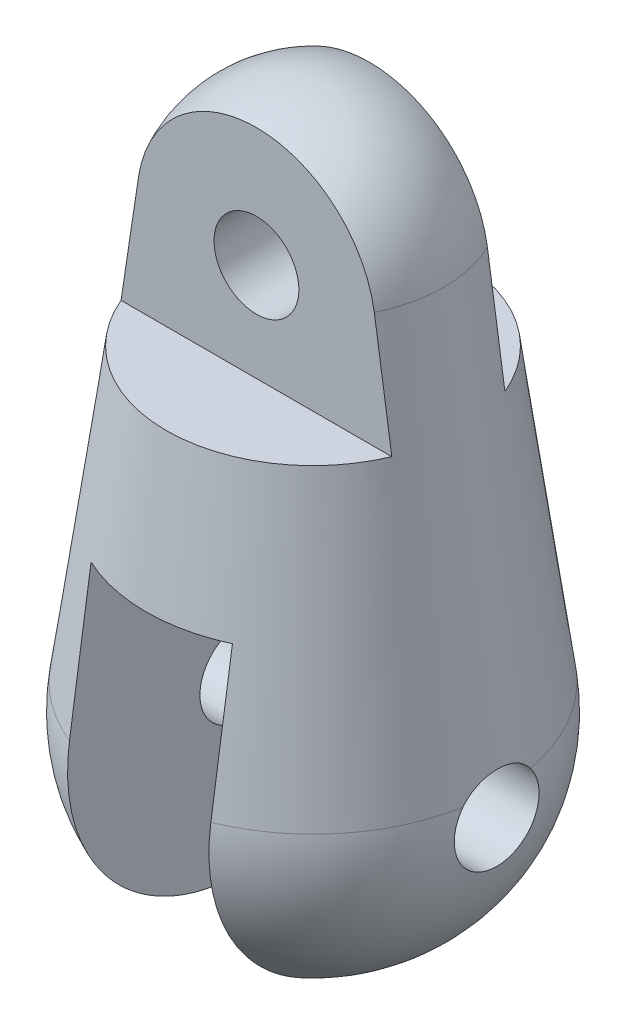
ISO-10303-21;
HEADER;
FILE_DESCRIPTION(('STEP AP214'),'2;1');
FILE_NAME('part.step','',(''),(''),'','','');
FILE_SCHEMA(('AUTOMOTIVE_DESIGN { 1 0 10303 214 1 1 1 1 }'));
ENDSEC;
DATA;
#1=APPLICATION_CONTEXT('core data for automotive mechanical design processes');
#2=APPLICATION_PROTOCOL_DEFINITION('international standard','automotive_design',2000,#1);
#3=PRODUCT_CONTEXT('',#1,'mechanical');
#4=PRODUCT('Part','Part','',(#3));
#5=PRODUCT_RELATED_PRODUCT_CATEGORY('part','',(#4));
#6=PRODUCT_DEFINITION_FORMATION('','',#4);
#7=PRODUCT_DEFINITION_CONTEXT('part definition',#1,'design');
#8=PRODUCT_DEFINITION('design','',#6,#7);
#9=PRODUCT_DEFINITION_SHAPE('','',#8);
#10=(LENGTH_UNIT() NAMED_UNIT(*) SI_UNIT(.MILLI.,.METRE.));
#11=(NAMED_UNIT(*) PLANE_ANGLE_UNIT() SI_UNIT($,.RADIAN.));
#12=(NAMED_UNIT(*) SI_UNIT($,.STERADIAN.) SOLID_ANGLE_UNIT());
#13=UNCERTAINTY_MEASURE_WITH_UNIT(LENGTH_MEASURE(1.E-05),#10,'distance_accuracy_value','');
#14=(GEOMETRIC_REPRESENTATION_CONTEXT(3) GLOBAL_UNCERTAINTY_ASSIGNED_CONTEXT((#13)) GLOBAL_UNIT_ASSIGNED_CONTEXT((#10,
#11,#12)) REPRESENTATION_CONTEXT('',''));
#15=CARTESIAN_POINT('',(0.,0.,0.));
#16=DIRECTION('',(0.,0.,1.));
#17=DIRECTION('',(1.,0.,0.));
#18=AXIS2_PLACEMENT_3D('',#15,#16,#17);
#19=CARTESIAN_POINT('',(0.,45.9090909090909,0.));
#20=DIRECTION('',(0.,-1.,0.));
#21=DIRECTION('',(1.,0.,0.));
#22=AXIS2_PLACEMENT_3D('',#19,#20,#21);
#23=CONICAL_SURFACE('',#22,13.8692239112658,0.136789826924246);
#24=CARTESIAN_POINT('',(19.4871752709508,2.72707272727272,-3.57953549223434));
#25=CARTESIAN_POINT('',(19.4871714866762,2.82761478626232,-3.50295494298203));
#26=CARTESIAN_POINT('',(19.4879661715478,2.92490889222046,-3.42212099023182));
#27=CARTESIAN_POINT('',(19.4908226238969,3.11233932568401,-3.25258004897354));
#28=CARTESIAN_POINT('',(19.4928842569054,3.20247641166085,-3.16387389684424));
#29=CARTESIAN_POINT('',(19.4979430032568,3.37488827849049,-2.97927462224909));
#30=CARTESIAN_POINT('',(19.5009394182816,3.4571688687152,-2.88338690518831));
#31=CARTESIAN_POINT('',(19.5075329575111,3.61337077756257,-2.6850481631585));
#32=CARTESIAN_POINT('',(19.5111300842399,3.68729206105794,-2.58259711061201));
#33=CARTESIAN_POINT('',(19.5186002404263,3.82626321423467,-2.37184404105321));
#34=CARTESIAN_POINT('',(19.5224732903195,3.89131242578348,-2.2635415908138));
#35=CARTESIAN_POINT('',(19.5301908904843,4.01210075478045,-2.04181090338331));
#36=CARTESIAN_POINT('',(19.5340354297305,4.06783643340104,-1.92838079246441));
#37=CARTESIAN_POINT('',(19.5414162802478,4.1695482612747,-1.69729064834706));
#38=CARTESIAN_POINT('',(19.5449527592723,4.21552974197854,-1.57963296719441));
#39=CARTESIAN_POINT('',(19.551483391942,4.29746048775397,-1.34081175074583));
#40=CARTESIAN_POINT('',(19.5544773463867,4.33340607052309,-1.2196469465897));
#41=CARTESIAN_POINT('',(19.5597338733168,4.39504122182331,-0.974483386375186));
#42=CARTESIAN_POINT('',(19.5619950924964,4.42071183359865,-0.850479834339897));
#43=CARTESIAN_POINT('',(19.5656379471728,4.4615228775192,-0.600694358689222));
#44=CARTESIAN_POINT('',(19.5670192754597,4.47665963198473,-0.474911829602854));
#45=CARTESIAN_POINT('',(19.5688162885817,4.49627670644428,-0.222521655833369));
#46=CARTESIAN_POINT('',(19.5692320507228,4.50075787955383,-0.0959140780198559));
#47=CARTESIAN_POINT('',(19.5690728699639,4.49903326543272,0.157227588944714));
#48=CARTESIAN_POINT('',(19.5684979284545,4.49282749320257,0.283761678198672));
#49=CARTESIAN_POINT('',(19.5663965916692,4.46982113322741,0.535341402398182));
#50=CARTESIAN_POINT('',(19.5648740302033,4.45306323330495,0.660390975928169));
#51=CARTESIAN_POINT('',(19.5609744537949,4.40912109589236,0.908586052971791));
#52=CARTESIAN_POINT('',(19.558597735459,4.38194047748032,1.03173220198762));
#53=CARTESIAN_POINT('',(19.5531361900926,4.31733116999907,1.27535964879118));
#54=CARTESIAN_POINT('',(19.550050988425,4.27989705698556,1.39583949958813));
#55=CARTESIAN_POINT('',(19.5433730253587,4.19506977819428,1.63317637105105));
#56=CARTESIAN_POINT('',(19.5397804481999,4.14768022443779,1.75003468807973));
#57=CARTESIAN_POINT('',(19.5323192983984,4.04312498515132,1.97967175319938));
#58=CARTESIAN_POINT('',(19.5284499950423,3.98593281468738,2.09243841910166));
#59=CARTESIAN_POINT('',(19.5207272616732,3.86228806304154,2.31272094878898));
#60=CARTESIAN_POINT('',(19.5168738263259,3.79583890953345,2.42023873631813));
#61=CARTESIAN_POINT('',(19.5094936521427,3.65417937629233,2.62923921184932));
#62=CARTESIAN_POINT('',(19.5059666844104,3.57897521977733,2.73072611014469));
#63=CARTESIAN_POINT('',(19.4995646014668,3.42032186295755,2.9269978447132));
#64=CARTESIAN_POINT('',(19.4966892363031,3.33687584190144,3.02178524125882));
#65=CARTESIAN_POINT('',(19.4920976564218,3.16867692695227,3.19736814124777));
#66=CARTESIAN_POINT('',(19.4903121478901,3.08446409403908,3.27867993057237));
#67=CARTESIAN_POINT('',(19.4878503987993,2.91010899891462,3.43437402380577));
#68=CARTESIAN_POINT('',(19.4871722323246,2.81997731561497,3.50876814604072));
#69=CARTESIAN_POINT('',(19.4871752709508,2.72707272727272,3.57953549223433));
#70=B_SPLINE_CURVE_WITH_KNOTS('',3,(#24,#25,#26,#27,#28,#29,#30,#31,#32,#33,#34,#35,#36,#37,#38,
#39,#40,#41,#42,#43,#44,#45,#46,#47,#48,#49,#50,#51,#52,#53,#54,#55,#56,#57,#58,#59,#60,#61,#62,
#63,#64,#65,#66,#67,#68,#69),.UNSPECIFIED.,.F.,.F.,(4,2,2,2,2,2,2,2,2,2,2,2,2,2,2,2,2,2,2,2,2,2,
4),(0.,0.379032679786271,0.758025137493641,1.13673514857442,1.51544675100284,1.89418643109287,
2.27306564537807,2.65173723516935,3.03054758248365,3.41005362779287,3.78969210345242,
4.16930018317431,4.5489077300678,4.92698938384569,5.30493987512321,5.68309068392969,
6.06110452873084,6.44015628108269,6.8190680494544,7.19771210621582,7.57621066959884,
7.92707952761813,8.27733749367502),.UNSPECIFIED.);
#71=CARTESIAN_POINT('',(19.4871752699051,2.72727272727272,-3.57938311320182));
#72=VERTEX_POINT('',#71);
#73=CARTESIAN_POINT('',(19.4871752699051,2.72727272727272,3.57938311320182));
#74=VERTEX_POINT('',#73);
#75=EDGE_CURVE('E65',#72,#74,#70,.T.);
#76=ORIENTED_EDGE('',*,*,#75,.F.);
#77=CARTESIAN_POINT('',(0.,2.72727272727272,0.));
#78=DIRECTION('',(0.,1.,0.));
#79=DIRECTION('',(-1.,0.,0.));
#80=AXIS2_PLACEMENT_3D('',#77,#78,#79);
#81=CIRCLE('',#80,19.813177016094);
#82=CARTESIAN_POINT('',(7.5,2.72727272727272,-18.3388108521538));
#83=VERTEX_POINT('',#82);
#84=EDGE_CURVE('E131',#72,#83,#81,.T.);
#85=ORIENTED_EDGE('',*,*,#84,.T.);
#86=CARTESIAN_POINT('',(7.50000000000001,60.4678833866813,-9.1941997906631));
#87=CARTESIAN_POINT('',(7.5,59.6111030481808,-9.34638563980166));
#88=CARTESIAN_POINT('',(7.5,58.7540680689737,-9.49713000666336));
#89=CARTESIAN_POINT('',(7.5,57.0395559323497,-9.79607226008006));
#90=CARTESIAN_POINT('',(7.5,56.1820787759375,-9.9442701523952));
#91=CARTESIAN_POINT('',(7.5,53.6090968959411,-10.3855467734735));
#92=CARTESIAN_POINT('',(7.5,51.893023760002,-10.6753116292695));
#93=CARTESIAN_POINT('',(7.5,48.4597839263785,-11.247920437124));
#94=CARTESIAN_POINT('',(7.5,46.742617266087,-11.5307646140335));
#95=CARTESIAN_POINT('',(7.5,43.3073756128075,-12.0909046778875));
#96=CARTESIAN_POINT('',(7.5,41.589300617452,-12.3682005502975));
#97=CARTESIAN_POINT('',(7.5,38.2150560302996,-12.9082343974905));
#98=CARTESIAN_POINT('',(7.5,36.5589123729097,-13.1711346141891));
#99=CARTESIAN_POINT('',(7.5,33.2460692458592,-13.6934112323765));
#100=CARTESIAN_POINT('',(7.5,31.589369775949,-13.9527876322797));
#101=CARTESIAN_POINT('',(7.5,26.6185730502316,-14.7264747119845));
#102=CARTESIAN_POINT('',(7.5,23.3037842104827,-15.236342199295));
#103=CARTESIAN_POINT('',(7.5,16.6728443437066,-16.2473738492367));
#104=CARTESIAN_POINT('',(7.5,13.3566933015871,-16.7485379126225));
#105=CARTESIAN_POINT('',(7.5,6.72339108932616,-17.7442086177347));
#106=CARTESIAN_POINT('',(7.5,3.40623991869986,-18.2387152562277));
#107=CARTESIAN_POINT('',(7.5,-3.2292871168763,-19.2225902824171));
#108=CARTESIAN_POINT('',(7.5,-6.54766308726356,-19.7119579583259));
#109=CARTESIAN_POINT('',(7.5,-13.18502734976,-20.6865312567169));
#110=CARTESIAN_POINT('',(7.5,-16.5040156421473,-21.1717368773041));
#111=CARTESIAN_POINT('',(7.5,-23.1423764140919,-22.1387572365351));
#112=CARTESIAN_POINT('',(7.49999999999999,-26.4617488777798,-22.6205720841841));
#113=CARTESIAN_POINT('',(7.49999999999999,-33.1008973991343,-23.5813907777003));
#114=CARTESIAN_POINT('',(7.49999999999999,-36.4206734564052,-24.0603946263008));
#115=CARTESIAN_POINT('',(7.49999999999999,-39.7406106594086,-24.5382754664104));
#116=B_SPLINE_CURVE_WITH_KNOTS('',3,(#86,#87,#88,#89,#90,#91,#92,#93,#94,#95,#96,#97,#98,#99,
#100,#101,#102,#103,#104,#105,#106,#107,#108,#109,#110,#111,#112,#113,#114,#115),.UNSPECIFIED.,
.F.,.F.,(4,2,2,2,2,2,2,2,2,2,2,2,2,2,4),(0.,2.61057085445666,5.22113580301888,10.4422108584417,
15.6631160567295,20.8840349301015,25.914672113893,30.9453115610393,41.0066109060134,
51.0680249049945,61.1294437904388,71.1922383541426,81.2550374991143,91.3175116576888,
101.379976030042),.UNSPECIFIED.);
#117=CARTESIAN_POINT('',(7.5,18.,-16.0444940547742));
#118=VERTEX_POINT('',#117);
#119=EDGE_CURVE('E312',#118,#83,#116,.T.);
#120=ORIENTED_EDGE('',*,*,#119,.F.);
#121=CARTESIAN_POINT('',(0.,18.,0.));
#122=DIRECTION('',(0.,1.,0.));
#123=DIRECTION('',(0.,0.,1.));
#124=AXIS2_PLACEMENT_3D('',#121,#122,#123);
#125=CIRCLE('',#124,17.7108946548074);
#126=CARTESIAN_POINT('',(-7.5,18.,-16.0444940547742));
#127=VERTEX_POINT('',#126);
#128=EDGE_CURVE('E319',#127,#118,#125,.F.);
#129=ORIENTED_EDGE('',*,*,#128,.F.);
#130=CARTESIAN_POINT('',(-7.5,60.4678833866813,-9.19419979066311));
#131=CARTESIAN_POINT('',(-7.5,59.6111030481808,-9.34638563980167));
#132=CARTESIAN_POINT('',(-7.5,58.7540680689737,-9.49713000666337));
#133=CARTESIAN_POINT('',(-7.5,57.0395559323497,-9.79607226008007));
#134=CARTESIAN_POINT('',(-7.5,56.1820787759375,-9.94427015239521));
#135=CARTESIAN_POINT('',(-7.5,53.6090968959411,-10.3855467734735));
#136=CARTESIAN_POINT('',(-7.5,51.893023760002,-10.6753116292695));
#137=CARTESIAN_POINT('',(-7.5,48.4597839263784,-11.247920437124));
#138=CARTESIAN_POINT('',(-7.5,46.742617266087,-11.5307646140335));
#139=CARTESIAN_POINT('',(-7.5,43.3073756128075,-12.0909046778875));
#140=CARTESIAN_POINT('',(-7.5,41.589300617452,-12.3682005502975));
#141=CARTESIAN_POINT('',(-7.5,38.2150560302996,-12.9082343974905));
#142=CARTESIAN_POINT('',(-7.5,36.5589123729097,-13.1711346141891));
#143=CARTESIAN_POINT('',(-7.5,33.2460692458592,-13.6934112323765));
#144=CARTESIAN_POINT('',(-7.5,31.589369775949,-13.9527876322797));
#145=CARTESIAN_POINT('',(-7.5,26.6185730502316,-14.7264747119845));
#146=CARTESIAN_POINT('',(-7.5,23.3037842104827,-15.236342199295));
#147=CARTESIAN_POINT('',(-7.5,16.6728443437066,-16.2473738492367));
#148=CARTESIAN_POINT('',(-7.5,13.3566933015871,-16.7485379126225));
#149=CARTESIAN_POINT('',(-7.5,6.72339108932616,-17.7442086177347));
#150=CARTESIAN_POINT('',(-7.5,3.40623991869986,-18.2387152562277));
#151=CARTESIAN_POINT('',(-7.5,-3.2292871168763,-19.2225902824171));
#152=CARTESIAN_POINT('',(-7.5,-6.54766308726355,-19.7119579583259));
#153=CARTESIAN_POINT('',(-7.5,-13.18502734976,-20.6865312567169));
#154=CARTESIAN_POINT('',(-7.5,-16.5040156421473,-21.1717368773041));
#155=CARTESIAN_POINT('',(-7.5,-23.1423764140919,-22.1387572365351));
#156=CARTESIAN_POINT('',(-7.5,-26.4617488777798,-22.6205720841841));
#157=CARTESIAN_POINT('',(-7.5,-33.1008973991343,-23.5813907777003));
#158=CARTESIAN_POINT('',(-7.5,-36.4206734564052,-24.0603946263008));
#159=CARTESIAN_POINT('',(-7.5,-39.7406106594085,-24.5382754664104));
#160=B_SPLINE_CURVE_WITH_KNOTS('',3,(#130,#131,#132,#133,#134,#135,#136,#137,#138,#139,#140,
#141,#142,#143,#144,#145,#146,#147,#148,#149,#150,#151,#152,#153,#154,#155,#156,#157,#158,#159),
.UNSPECIFIED.,.F.,.F.,(4,2,2,2,2,2,2,2,2,2,2,2,2,2,4),(0.,2.61057085445666,5.22113580301887,
10.4422108584417,15.6631160567295,20.8840349301015,25.914672113893,30.9453115610393,
41.0066109060134,51.0680249049945,61.1294437904388,71.1922383541425,81.2550374991142,
91.3175116576888,101.379976030042),.UNSPECIFIED.);
#161=CARTESIAN_POINT('',(-7.5,2.72727272727272,-18.3388108521538));
#162=VERTEX_POINT('',#161);
#163=EDGE_CURVE('E325',#127,#162,#160,.T.);
#164=ORIENTED_EDGE('',*,*,#163,.T.);
#165=CARTESIAN_POINT('',(-19.4871752699051,2.72727272727272,-3.57938311320182));
#166=VERTEX_POINT('',#165);
#167=EDGE_CURVE('E141',#162,#166,#81,.T.);
#168=ORIENTED_EDGE('',*,*,#167,.T.);
#169=CARTESIAN_POINT('',(-19.4871752709508,2.72707272727272,3.57953549223434));
#170=CARTESIAN_POINT('',(-19.4871714866762,2.82761478626232,3.50295494298203));
#171=CARTESIAN_POINT('',(-19.4879661715478,2.92490889222046,3.42212099023182));
#172=CARTESIAN_POINT('',(-19.4908226238969,3.11233932568401,3.25258004897354));
#173=CARTESIAN_POINT('',(-19.4928842569054,3.20247641166085,3.16387389684424));
#174=CARTESIAN_POINT('',(-19.4979430032568,3.37488827849049,2.97927462224909));
#175=CARTESIAN_POINT('',(-19.5009394182816,3.4571688687152,2.88338690518831));
#176=CARTESIAN_POINT('',(-19.5075329575111,3.61337077756257,2.6850481631585));
#177=CARTESIAN_POINT('',(-19.5111300842399,3.68729206105794,2.58259711061201));
#178=CARTESIAN_POINT('',(-19.5186002404263,3.82626321423467,2.37184404105321));
#179=CARTESIAN_POINT('',(-19.5224732903195,3.89131242578348,2.2635415908138));
#180=CARTESIAN_POINT('',(-19.5301908904843,4.01210075478045,2.04181090338331));
#181=CARTESIAN_POINT('',(-19.5340354297305,4.06783643340104,1.92838079246441));
#182=CARTESIAN_POINT('',(-19.5414162802478,4.1695482612747,1.69729064834706));
#183=CARTESIAN_POINT('',(-19.5449527592723,4.21552974197854,1.57963296719441));
#184=CARTESIAN_POINT('',(-19.551483391942,4.29746048775397,1.34081175074583));
#185=CARTESIAN_POINT('',(-19.5544773463867,4.33340607052309,1.2196469465897));
#186=CARTESIAN_POINT('',(-19.5597338733168,4.39504122182331,0.974483386375186));
#187=CARTESIAN_POINT('',(-19.5619950924964,4.42071183359865,0.850479834339897));
#188=CARTESIAN_POINT('',(-19.5656379471728,4.4615228775192,0.600694358689222));
#189=CARTESIAN_POINT('',(-19.5670192754597,4.47665963198473,0.474911829602854));
#190=CARTESIAN_POINT('',(-19.5688162885817,4.49627670644428,0.222521655833369));
#191=CARTESIAN_POINT('',(-19.5692320507228,4.50075787955383,0.0959140780198559));
#192=CARTESIAN_POINT('',(-19.5690728699639,4.49903326543272,-0.157227588944714));
#193=CARTESIAN_POINT('',(-19.5684979284545,4.49282749320257,-0.283761678198672));
#194=CARTESIAN_POINT('',(-19.5663965916692,4.46982113322741,-0.535341402398182));
#195=CARTESIAN_POINT('',(-19.5648740302033,4.45306323330495,-0.660390975928169));
#196=CARTESIAN_POINT('',(-19.5609744537949,4.40912109589236,-0.908586052971791));
#197=CARTESIAN_POINT('',(-19.558597735459,4.38194047748032,-1.03173220198762));
#198=CARTESIAN_POINT('',(-19.5531361900926,4.31733116999907,-1.27535964879118));
#199=CARTESIAN_POINT('',(-19.550050988425,4.27989705698556,-1.39583949958813));
#200=CARTESIAN_POINT('',(-19.5433730253587,4.19506977819428,-1.63317637105105));
#201=CARTESIAN_POINT('',(-19.5397804481999,4.14768022443779,-1.75003468807973));
#202=CARTESIAN_POINT('',(-19.5323192983984,4.04312498515132,-1.97967175319938));
#203=CARTESIAN_POINT('',(-19.5284499950423,3.98593281468738,-2.09243841910166));
#204=CARTESIAN_POINT('',(-19.5207272616732,3.86228806304154,-2.31272094878898));
#205=CARTESIAN_POINT('',(-19.5168738263259,3.79583890953345,-2.42023873631813));
#206=CARTESIAN_POINT('',(-19.5094936521427,3.65417937629233,-2.62923921184932));
#207=CARTESIAN_POINT('',(-19.5059666844104,3.57897521977733,-2.73072611014469));
#208=CARTESIAN_POINT('',(-19.4995646014668,3.42032186295755,-2.9269978447132));
#209=CARTESIAN_POINT('',(-19.4966892363031,3.33687584190144,-3.02178524125882));
#210=CARTESIAN_POINT('',(-19.4920976564218,3.16867692695227,-3.19736814124777));
#211=CARTESIAN_POINT('',(-19.4903121478901,3.08446409403908,-3.27867993057237));
#212=CARTESIAN_POINT('',(-19.4878503987993,2.91010899891462,-3.43437402380577));
#213=CARTESIAN_POINT('',(-19.4871722323246,2.81997731561497,-3.50876814604072));
#214=CARTESIAN_POINT('',(-19.4871752709508,2.72707272727272,-3.57953549223433));
#215=B_SPLINE_CURVE_WITH_KNOTS('',3,(#169,#170,#171,#172,#173,#174,#175,#176,#177,#178,#179,
#180,#181,#182,#183,#184,#185,#186,#187,#188,#189,#190,#191,#192,#193,#194,#195,#196,#197,#198,
#199,#200,#201,#202,#203,#204,#205,#206,#207,#208,#209,#210,#211,#212,#213,#214),.UNSPECIFIED.,
.F.,.F.,(4,2,2,2,2,2,2,2,2,2,2,2,2,2,2,2,2,2,2,2,2,2,4),(0.,0.379032679786271,0.758025137493641,
1.13673514857442,1.51544675100284,1.89418643109287,2.27306564537807,2.65173723516935,
3.03054758248365,3.41005362779287,3.78969210345242,4.16930018317431,4.5489077300678,
4.92698938384569,5.30493987512321,5.68309068392969,6.06110452873084,6.44015628108269,
6.8190680494544,7.19771210621582,7.57621066959884,7.92707952761813,8.27733749367502),.UNSPECIFIED.);
#216=CARTESIAN_POINT('',(-19.4871752699051,2.72727272727272,3.57938311320182));
#217=VERTEX_POINT('',#216);
#218=EDGE_CURVE('E58',#217,#166,#215,.T.);
#219=ORIENTED_EDGE('',*,*,#218,.F.);
#220=CARTESIAN_POINT('',(-7.5,2.72727272727272,18.3388108521538));
#221=VERTEX_POINT('',#220);
#222=EDGE_CURVE('E143',#217,#221,#81,.T.);
#223=ORIENTED_EDGE('',*,*,#222,.T.);
#224=CARTESIAN_POINT('',(-7.5,-39.7406106594085,24.5382754664104));
#225=CARTESIAN_POINT('',(-7.5,-36.0156219309958,24.0020771878823));
#226=CARTESIAN_POINT('',(-7.5,-32.2908332072166,23.4644832640725));
#227=CARTESIAN_POINT('',(-7.5,-24.841794621953,22.3856733544891));
#228=CARTESIAN_POINT('',(-7.5,-21.117544758514,21.8444573822084));
#229=CARTESIAN_POINT('',(-7.5,-13.6698239531929,20.7575874414219));
#230=CARTESIAN_POINT('',(-7.5,-9.94635298880502,20.211933627236));
#231=CARTESIAN_POINT('',(-7.5,-2.50022855230797,19.1149610690792));
#232=CARTESIAN_POINT('',(-7.5,1.22242491628843,18.5636423012344));
#233=CARTESIAN_POINT('',(-7.5,7.26135898166691,17.6631730694177));
#234=CARTESIAN_POINT('',(-7.5,9.57797624970253,17.3162807621428));
#235=CARTESIAN_POINT('',(-7.5,14.2106951133654,16.6190733587013));
#236=CARTESIAN_POINT('',(-7.5,16.5267967091926,16.268758263865));
#237=CARTESIAN_POINT('',(-7.5,21.1583470716812,15.5639945278905));
#238=CARTESIAN_POINT('',(-7.5,23.4737958447939,15.2095459291806));
#239=CARTESIAN_POINT('',(-7.5,28.1039145704937,14.4955672552004));
#240=CARTESIAN_POINT('',(-7.5,30.4185845218134,14.1360371717016));
#241=CARTESIAN_POINT('',(-7.5,35.0470474303577,13.4106009457005));
#242=CARTESIAN_POINT('',(-7.5,37.3608403366331,13.0446944778038));
#243=CARTESIAN_POINT('',(-7.5,41.9871209862789,12.304764352065));
#244=CARTESIAN_POINT('',(-7.5,44.2996087355565,11.9307407312696));
#245=CARTESIAN_POINT('',(-7.5,47.7670630153544,11.3616594926999));
#246=CARTESIAN_POINT('',(-7.5,48.9226893176009,11.1706212151712));
#247=CARTESIAN_POINT('',(-7.5,51.2334182618968,10.785409724786));
#248=CARTESIAN_POINT('',(-7.5,52.3885209046041,10.5912365158787));
#249=CARTESIAN_POINT('',(-7.5,54.6981223542171,10.1992201042173));
#250=CARTESIAN_POINT('',(-7.5,55.8526211517061,10.0013768458869));
#251=CARTESIAN_POINT('',(-7.5,58.1608590961654,9.60128073000464));
#252=CARTESIAN_POINT('',(-7.5,59.3145982398096,9.39902785327595));
#253=CARTESIAN_POINT('',(-7.5,60.4678833866813,9.19419979066312));
#254=B_SPLINE_CURVE_WITH_KNOTS('',3,(#224,#225,#226,#227,#228,#229,#230,#231,#232,#233,#234,
#235,#236,#237,#238,#239,#240,#241,#242,#243,#244,#245,#246,#247,#248,#249,#250,#251,#252,#253),
.UNSPECIFIED.,.F.,.F.,(4,2,2,2,2,2,2,2,2,2,2,2,2,2,4),(0.,11.290149290512,22.5802565462515,
33.8699728684334,45.1597367886618,52.1870705865176,59.2144016532429,66.241660651184,
73.26893102967,80.296561074177,87.3241590512302,90.8380864291054,94.3520093809199,
97.8659855883882,101.37997708072),.UNSPECIFIED.);
#255=CARTESIAN_POINT('',(-7.5,18.,16.0444940547742));
#256=VERTEX_POINT('',#255);
#257=EDGE_CURVE('E320',#221,#256,#254,.T.);
#258=ORIENTED_EDGE('',*,*,#257,.T.);
#259=CARTESIAN_POINT('',(7.5,18.,16.0444940547742));
#260=VERTEX_POINT('',#259);
#261=EDGE_CURVE('E298',#260,#256,#125,.F.);
#262=ORIENTED_EDGE('',*,*,#261,.F.);
#263=CARTESIAN_POINT('',(7.49999999999999,-39.7406106594085,24.5382754664104));
#264=CARTESIAN_POINT('',(7.49999999999999,-36.0156219309957,24.0020771878823));
#265=CARTESIAN_POINT('',(7.49999999999999,-32.2908332072166,23.4644832640725));
#266=CARTESIAN_POINT('',(7.49999999999999,-24.841794621953,22.3856733544891));
#267=CARTESIAN_POINT('',(7.49999999999999,-21.117544758514,21.8444573822084));
#268=CARTESIAN_POINT('',(7.5,-13.6698239531929,20.7575874414219));
#269=CARTESIAN_POINT('',(7.5,-9.94635298880503,20.211933627236));
#270=CARTESIAN_POINT('',(7.5,-2.50022855230797,19.1149610690792));
#271=CARTESIAN_POINT('',(7.5,1.22242491628844,18.5636423012344));
#272=CARTESIAN_POINT('',(7.5,7.26135898166692,17.6631730694177));
#273=CARTESIAN_POINT('',(7.5,9.57797624970254,17.3162807621428));
#274=CARTESIAN_POINT('',(7.5,14.2106951133654,16.6190733587013));
#275=CARTESIAN_POINT('',(7.5,16.5267967091927,16.268758263865));
#276=CARTESIAN_POINT('',(7.5,21.1583470716812,15.5639945278905));
#277=CARTESIAN_POINT('',(7.5,23.4737958447939,15.2095459291806));
#278=CARTESIAN_POINT('',(7.5,28.1039145704937,14.4955672552004));
#279=CARTESIAN_POINT('',(7.5,30.4185845218134,14.1360371717016));
#280=CARTESIAN_POINT('',(7.5,35.0470474303577,13.4106009457004));
#281=CARTESIAN_POINT('',(7.5,37.3608403366332,13.0446944778038));
#282=CARTESIAN_POINT('',(7.5,41.9871209862789,12.3047643520649));
#283=CARTESIAN_POINT('',(7.5,44.2996087355565,11.9307407312696));
#284=CARTESIAN_POINT('',(7.5,47.7670630153544,11.3616594926999));
#285=CARTESIAN_POINT('',(7.5,48.9226893176008,11.1706212151712));
#286=CARTESIAN_POINT('',(7.5,51.2334182618968,10.785409724786));
#287=CARTESIAN_POINT('',(7.5,52.388520904604,10.5912365158786));
#288=CARTESIAN_POINT('',(7.5,54.6981223542171,10.1992201042173));
#289=CARTESIAN_POINT('',(7.5,55.8526211517061,10.0013768458869));
#290=CARTESIAN_POINT('',(7.5,58.1608590961654,9.60128073000464));
#291=CARTESIAN_POINT('',(7.5,59.3145982398096,9.39902785327594));
#292=CARTESIAN_POINT('',(7.50000000000001,60.4678833866813,9.19419979066311));
#293=B_SPLINE_CURVE_WITH_KNOTS('',3,(#263,#264,#265,#266,#267,#268,#269,#270,#271,#272,#273,
#274,#275,#276,#277,#278,#279,#280,#281,#282,#283,#284,#285,#286,#287,#288,#289,#290,#291,#292),
.UNSPECIFIED.,.F.,.F.,(4,2,2,2,2,2,2,2,2,2,2,2,2,2,4),(0.,11.290149290512,22.5802565462515,
33.8699728684334,45.1597367886618,52.1870705865176,59.2144016532429,66.241660651184,
73.26893102967,80.296561074177,87.3241590512302,90.8380864291054,94.3520093809199,
97.8659855883883,101.37997708072),.UNSPECIFIED.);
#294=CARTESIAN_POINT('',(7.5,2.72727272727272,18.3388108521538));
#295=VERTEX_POINT('',#294);
#296=EDGE_CURVE('E295',#295,#260,#293,.T.);
#297=ORIENTED_EDGE('',*,*,#296,.F.);
#298=EDGE_CURVE('E134',#295,#74,#81,.T.);
#299=ORIENTED_EDGE('',*,*,#298,.T.);
#300=EDGE_LOOP('',(#76,#85,#120,#129,#164,#168,#219,#223,#258,#262,#297,#299));
#301=FACE_BOUND('',#300,.T.);
#302=CARTESIAN_POINT('',(-5.52626184361416,87.4061348010254,6.));
#303=CARTESIAN_POINT('',(-5.64537786953995,86.819739467445,6.));
#304=CARTESIAN_POINT('',(-5.76254658808977,86.2329522697909,6.));
#305=CARTESIAN_POINT('',(-5.99352663585799,85.0587227081783,6.));
#306=CARTESIAN_POINT('',(-6.10733799696479,84.4712803504977,6.));
#307=CARTESIAN_POINT('',(-6.33213855544944,83.2958800673933,6.));
#308=CARTESIAN_POINT('',(-6.4431278591928,82.7079221622676,6.));
#309=CARTESIAN_POINT('',(-6.66267803506595,81.5315519644335,6.));
#310=CARTESIAN_POINT('',(-6.77123890047584,80.9431396704723,6.));
#311=CARTESIAN_POINT('',(-7.09375673388289,79.1774568561448,6.));
#312=CARTESIAN_POINT('',(-7.30457324588478,77.9996124872364,6.));
#313=CARTESIAN_POINT('',(-7.71976024414986,75.6427788487111,6.));
#314=CARTESIAN_POINT('',(-7.92413065624152,74.4637895660812,6.));
#315=CARTESIAN_POINT('',(-8.3277263809323,72.1050471715468,6.));
#316=CARTESIAN_POINT('',(-8.52695218045521,70.9252941428433,6.));
#317=CARTESIAN_POINT('',(-8.92124895437912,68.5650931750713,6.));
#318=CARTESIAN_POINT('',(-9.11631992214832,67.3846452348966,6.));
#319=CARTESIAN_POINT('',(-9.5030344539381,65.0231809162521,6.));
#320=CARTESIAN_POINT('',(-9.69467799609048,63.8421645342047,6.));
#321=CARTESIAN_POINT('',(-10.0750904070373,61.479668601292,6.));
#322=CARTESIAN_POINT('',(-10.2638592739598,60.2981890501256,6.));
#323=CARTESIAN_POINT('',(-10.8265398183163,56.7531315132882,6.));
#324=CARTESIAN_POINT('',(-11.1968185616469,54.3889768574597,6.));
#325=CARTESIAN_POINT('',(-11.9302251964965,49.6595702497223,6.));
#326=CARTESIAN_POINT('',(-12.2933531126697,47.2943183016255,6.));
#327=CARTESIAN_POINT('',(-13.0141842232175,42.5625799083861,6.));
#328=CARTESIAN_POINT('',(-13.3718864909435,40.1960933222068,6.));
#329=CARTESIAN_POINT('',(-14.0829852377871,35.4624720969351,6.));
#330=CARTESIAN_POINT('',(-14.436381713476,33.0953374573281,6.));
#331=CARTESIAN_POINT('',(-15.1397183466359,28.3605845345835,6.));
#332=CARTESIAN_POINT('',(-15.4896585461141,25.9929662576819,6.));
#333=CARTESIAN_POINT('',(-16.1867252990472,21.2573155090176,6.));
#334=CARTESIAN_POINT('',(-16.5338518522007,18.8892830372108,6.));
#335=CARTESIAN_POINT('',(-17.177150914538,14.4857345862667,6.));
#336=CARTESIAN_POINT('',(-17.4736276617236,12.4502630294265,6.));
#337=CARTESIAN_POINT('',(-18.0651049606565,8.37910085447147,6.));
#338=CARTESIAN_POINT('',(-18.3601055091135,6.34341023587871,6.));
#339=CARTESIAN_POINT('',(-18.948787038267,2.27214958604445,6.));
#340=CARTESIAN_POINT('',(-19.2424682100153,0.236579582420087,6.));
#341=CARTESIAN_POINT('',(-19.8287132969387,-3.83471637572808,6.));
#342=CARTESIAN_POINT('',(-20.1212772147699,-5.87044232986937,6.));
#343=CARTESIAN_POINT('',(-20.413362120428,-7.9062369180059,6.));
#344=B_SPLINE_CURVE_WITH_KNOTS('',3,(#302,#303,#304,#305,#306,#307,#308,#309,#310,#311,#312,
#313,#314,#315,#316,#317,#318,#319,#320,#321,#322,#323,#324,#325,#326,#327,#328,#329,#330,#331,
#332,#333,#334,#335,#336,#337,#338,#339,#340,#341,#342,#343),.UNSPECIFIED.,.F.,.F.,(4,2,2,2,2,2,
2,2,2,2,2,2,2,2,2,2,2,2,2,2,4),(0.,1.79510509995067,3.59019314437905,5.38521342995574,
7.18023868203398,10.7698985811246,14.3595997692893,17.9489599472376,21.5383258539581,
25.1277146539459,28.7171057910828,35.8960163736333,43.0749022007979,50.255000611769,
57.4351047397861,64.6151214939709,71.7951390172584,77.9659881468946,84.1368510243872,
90.3067895048061,96.476713307788),.UNSPECIFIED.);
#345=CARTESIAN_POINT('',(-12.5042141656654,45.9090909090909,6.));
#346=VERTEX_POINT('',#345);
#347=CARTESIAN_POINT('',(-14.3618903906918,33.5908069739285,6.));
#348=VERTEX_POINT('',#347);
#349=EDGE_CURVE('E167',#346,#348,#344,.T.);
#350=ORIENTED_EDGE('',*,*,#349,.F.);
#351=CARTESIAN_POINT('',(0.,45.9090909090909,0.));
#352=DIRECTION('',(0.,1.,0.));
#353=DIRECTION('',(-1.,0.,0.));
#354=AXIS2_PLACEMENT_3D('',#351,#352,#353);
#355=CIRCLE('',#354,13.8692239112658);
#356=CARTESIAN_POINT('',(-12.5042141656654,45.9090909090909,-6.));
#357=VERTEX_POINT('',#356);
#358=EDGE_CURVE('E146',#357,#346,#355,.T.);
#359=ORIENTED_EDGE('',*,*,#358,.F.);
#360=CARTESIAN_POINT('',(-5.52626184361416,87.4061348010254,-6.));
#361=CARTESIAN_POINT('',(-5.64537786953996,86.819739467445,-6.));
#362=CARTESIAN_POINT('',(-5.76254658808977,86.2329522697909,-6.));
#363=CARTESIAN_POINT('',(-5.99352663585799,85.0587227081783,-6.));
#364=CARTESIAN_POINT('',(-6.10733799696479,84.4712803504977,-6.));
#365=CARTESIAN_POINT('',(-6.33213855544944,83.2958800673932,-6.));
#366=CARTESIAN_POINT('',(-6.44312785919281,82.7079221622676,-6.));
#367=CARTESIAN_POINT('',(-6.66267803506595,81.5315519644334,-6.));
#368=CARTESIAN_POINT('',(-6.77123890047585,80.9431396704723,-6.));
#369=CARTESIAN_POINT('',(-7.09375673388289,79.1774568561448,-6.));
#370=CARTESIAN_POINT('',(-7.30457324588478,77.9996124872364,-6.));
#371=CARTESIAN_POINT('',(-7.71976024414986,75.6427788487111,-6.));
#372=CARTESIAN_POINT('',(-7.92413065624152,74.4637895660812,-6.));
#373=CARTESIAN_POINT('',(-8.3277263809323,72.1050471715468,-6.));
#374=CARTESIAN_POINT('',(-8.52695218045521,70.9252941428433,-6.));
#375=CARTESIAN_POINT('',(-8.92124895437912,68.5650931750713,-6.));
#376=CARTESIAN_POINT('',(-9.11631992214832,67.3846452348966,-6.));
#377=CARTESIAN_POINT('',(-9.5030344539381,65.0231809162521,-6.));
#378=CARTESIAN_POINT('',(-9.69467799609048,63.8421645342047,-6.));
#379=CARTESIAN_POINT('',(-10.0750904070373,61.479668601292,-6.));
#380=CARTESIAN_POINT('',(-10.2638592739598,60.2981890501256,-6.));
#381=CARTESIAN_POINT('',(-10.8265398183163,56.7531315132882,-6.));
#382=CARTESIAN_POINT('',(-11.1968185616469,54.3889768574597,-6.));
#383=CARTESIAN_POINT('',(-11.9302251964965,49.6595702497223,-6.));
#384=CARTESIAN_POINT('',(-12.2933531126697,47.2943183016255,-6.));
#385=CARTESIAN_POINT('',(-13.0141842232175,42.5625799083861,-6.));
#386=CARTESIAN_POINT('',(-13.3718864909435,40.1960933222068,-6.));
#387=CARTESIAN_POINT('',(-14.0829852377871,35.4624720969351,-6.));
#388=CARTESIAN_POINT('',(-14.436381713476,33.0953374573281,-6.));
#389=CARTESIAN_POINT('',(-15.1397183466359,28.3605845345835,-6.));
#390=CARTESIAN_POINT('',(-15.4896585461141,25.9929662576819,-6.));
#391=CARTESIAN_POINT('',(-16.1867252990472,21.2573155090177,-6.));
#392=CARTESIAN_POINT('',(-16.5338518522007,18.8892830372108,-6.));
#393=CARTESIAN_POINT('',(-17.177150914538,14.4857345862667,-6.));
#394=CARTESIAN_POINT('',(-17.4736276617236,12.4502630294265,-6.));
#395=CARTESIAN_POINT('',(-18.0651049606565,8.37910085447147,-6.));
#396=CARTESIAN_POINT('',(-18.3601055091135,6.34341023587871,-6.));
#397=CARTESIAN_POINT('',(-18.948787038267,2.27214958604445,-6.));
#398=CARTESIAN_POINT('',(-19.2424682100153,0.236579582420087,-6.));
#399=CARTESIAN_POINT('',(-19.8287132969387,-3.83471637572808,-6.));
#400=CARTESIAN_POINT('',(-20.1212772147699,-5.87044232986937,-6.));
#401=CARTESIAN_POINT('',(-20.413362120428,-7.9062369180059,-6.));
#402=B_SPLINE_CURVE_WITH_KNOTS('',3,(#360,#361,#362,#363,#364,#365,#366,#367,#368,#369,#370,
#371,#372,#373,#374,#375,#376,#377,#378,#379,#380,#381,#382,#383,#384,#385,#386,#387,#388,#389,
#390,#391,#392,#393,#394,#395,#396,#397,#398,#399,#400,#401),.UNSPECIFIED.,.F.,.F.,(4,2,2,2,2,2,
2,2,2,2,2,2,2,2,2,2,2,2,2,2,4),(0.,1.79510509995066,3.59019314437905,5.38521342995579,
7.18023868203398,10.7698985811246,14.3595997692893,17.9489599472376,21.5383258539581,
25.1277146539459,28.7171057910828,35.8960163736333,43.0749022007979,50.255000611769,
57.4351047397861,64.6151214939709,71.7951390172584,77.9659881468946,84.1368510243872,
90.3067895048061,96.476713307788),.UNSPECIFIED.);
#403=CARTESIAN_POINT('',(-14.3618903906918,33.5908069739285,-6.));
#404=VERTEX_POINT('',#403);
#405=EDGE_CURVE('E216',#357,#404,#402,.T.);
#406=ORIENTED_EDGE('',*,*,#405,.T.);
#407=CARTESIAN_POINT('',(0.,33.5908069739285,0.));
#408=DIRECTION('',(0.,-1.,0.));
#409=DIRECTION('',(0.,0.,-1.));
#410=AXIS2_PLACEMENT_3D('',#407,#408,#409);
#411=CIRCLE('',#410,15.5648288006725);
#412=CARTESIAN_POINT('',(14.3618903906918,33.5908069739285,-6.));
#413=VERTEX_POINT('',#412);
#414=EDGE_CURVE('E51',#413,#404,#411,.F.);
#415=ORIENTED_EDGE('',*,*,#414,.F.);
#416=CARTESIAN_POINT('',(20.4133621204279,-7.9062369180059,-6.));
#417=CARTESIAN_POINT('',(19.9701343892104,-4.81714704740977,-6.));
#418=CARTESIAN_POINT('',(19.5258369561669,-1.72821014263476,-6.));
#419=CARTESIAN_POINT('',(18.6344804856897,4.4492267006616,-6.));
#420=CARTESIAN_POINT('',(18.1874214819477,7.53772664404561,-6.));
#421=CARTESIAN_POINT('',(17.2899347111371,13.7140561769958,-6.));
#422=CARTESIAN_POINT('',(16.8395071392615,16.8018857948969,-6.));
#423=CARTESIAN_POINT('',(16.1606224325403,21.4331733489669,-6.));
#424=CARTESIAN_POINT('',(15.9337856231471,22.9768688353882,-6.));
#425=CARTESIAN_POINT('',(15.4788810927271,26.0640794922183,-6.));
#426=CARTESIAN_POINT('',(15.2508133708871,27.6075946625073,-6.));
#427=CARTESIAN_POINT('',(14.6614533879844,31.5837804955441,-6.));
#428=CARTESIAN_POINT('',(14.2991212367967,34.0162971797582,-6.));
#429=CARTESIAN_POINT('',(13.5701112433022,38.8806743295301,-6.));
#430=CARTESIAN_POINT('',(13.2034334107773,41.3125347965524,-6.));
#431=CARTESIAN_POINT('',(12.4645362648988,46.1753287314624,-6.));
#432=CARTESIAN_POINT('',(12.0923171430121,48.6062622284166,-6.));
#433=CARTESIAN_POINT('',(11.3406162352931,53.4670316626445,-6.));
#434=CARTESIAN_POINT('',(10.9611343844706,55.8968675898974,-6.));
#435=CARTESIAN_POINT('',(10.3844799956384,59.5406156848831,-6.));
#436=CARTESIAN_POINT('',(10.1910097734612,60.7551138055133,-6.));
#437=CARTESIAN_POINT('',(9.80113179034206,63.183637742153,-6.));
#438=CARTESIAN_POINT('',(9.60472403229033,64.3976635586259,-6.));
#439=CARTESIAN_POINT('',(9.2084011291166,66.8251117489073,-6.));
#440=CARTESIAN_POINT('',(9.00848607246942,68.0385341371459,-6.));
#441=CARTESIAN_POINT('',(8.60438659934404,70.4646737254585,-6.));
#442=CARTESIAN_POINT('',(8.40020216665027,71.6773909228361,-6.));
#443=CARTESIAN_POINT('',(7.98652310126417,74.1020865639491,-6.));
#444=CARTESIAN_POINT('',(7.77702776577983,75.3140648879489,-6.));
#445=CARTESIAN_POINT('',(7.35136554999347,77.7368409994892,-6.));
#446=CARTESIAN_POINT('',(7.13519874078925,78.9476387994688,-6.));
#447=CARTESIAN_POINT('',(6.80440477593302,80.762697380396,-6.));
#448=CARTESIAN_POINT('',(6.69304446479451,81.367553741868,-6.));
#449=CARTESIAN_POINT('',(6.4677896422467,82.5767931400553,-6.));
#450=CARTESIAN_POINT('',(6.35389513819133,83.1811761781387,-6.));
#451=CARTESIAN_POINT('',(6.12315211308732,84.3894015169097,-6.));
#452=CARTESIAN_POINT('',(6.00630348788286,84.9932437977518,-6.));
#453=CARTESIAN_POINT('',(5.76907541439523,86.200240082475,-6.));
#454=CARTESIAN_POINT('',(5.64869593077138,86.8033940794041,-6.));
#455=CARTESIAN_POINT('',(5.52626184361416,87.4061348010253,-6.));
#456=B_SPLINE_CURVE_WITH_KNOTS('',3,(#416,#417,#418,#419,#420,#421,#422,#423,#424,#425,#426,
#427,#428,#429,#430,#431,#432,#433,#434,#435,#436,#437,#438,#439,#440,#441,#442,#443,#444,#445,
#446,#447,#448,#449,#450,#451,#452,#453,#454,#455),.UNSPECIFIED.,.F.,.F.,(4,2,2,2,2,2,2,2,2,2,2,
2,2,2,2,2,2,2,2,4),(0.,9.36217675553642,18.7242395147114,28.0857639246964,32.7665814085819,
37.4474019849306,44.8254607848764,52.2035029804093,59.5812908329393,66.9591447361089,
70.6485765440173,74.3380047222039,78.0273399646132,81.7166892220881,85.4065292663643,
89.0963300016335,90.9413923288525,92.786449302612,94.6315714200009,96.4767120116915),.UNSPECIFIED.);
#457=CARTESIAN_POINT('',(12.5042141656654,45.9090909090909,-6.));
#458=VERTEX_POINT('',#457);
#459=EDGE_CURVE('E210',#413,#458,#456,.T.);
#460=ORIENTED_EDGE('',*,*,#459,.T.);
#461=CARTESIAN_POINT('',(12.5042141656654,45.9090909090909,6.));
#462=VERTEX_POINT('',#461);
#463=EDGE_CURVE('E289',#462,#458,#355,.T.);
#464=ORIENTED_EDGE('',*,*,#463,.F.);
#465=CARTESIAN_POINT('',(20.4133621204279,-7.9062369180059,6.));
#466=CARTESIAN_POINT('',(19.9701343892104,-4.81714704740978,6.));
#467=CARTESIAN_POINT('',(19.5258369561669,-1.72821014263476,6.));
#468=CARTESIAN_POINT('',(18.6344804856897,4.44922670066161,6.));
#469=CARTESIAN_POINT('',(18.1874214819477,7.53772664404561,6.));
#470=CARTESIAN_POINT('',(17.2899347111371,13.7140561769958,6.));
#471=CARTESIAN_POINT('',(16.8395071392615,16.8018857948969,6.));
#472=CARTESIAN_POINT('',(16.1606224325403,21.4331733489669,6.));
#473=CARTESIAN_POINT('',(15.9337856231471,22.9768688353882,6.));
#474=CARTESIAN_POINT('',(15.4788810927271,26.0640794922183,6.));
#475=CARTESIAN_POINT('',(15.2508133708871,27.6075946625073,6.));
#476=CARTESIAN_POINT('',(14.6614533879844,31.5837804955441,6.));
#477=CARTESIAN_POINT('',(14.2991212367967,34.0162971797582,6.));
#478=CARTESIAN_POINT('',(13.5701112433022,38.8806743295301,6.));
#479=CARTESIAN_POINT('',(13.2034334107773,41.3125347965524,6.));
#480=CARTESIAN_POINT('',(12.4645362648988,46.1753287314624,6.));
#481=CARTESIAN_POINT('',(12.0923171430121,48.6062622284165,6.));
#482=CARTESIAN_POINT('',(11.3406162352931,53.4670316626445,6.));
#483=CARTESIAN_POINT('',(10.9611343844706,55.8968675898974,6.));
#484=CARTESIAN_POINT('',(10.3844799956384,59.5406156848831,6.));
#485=CARTESIAN_POINT('',(10.1910097734612,60.7551138055133,6.));
#486=CARTESIAN_POINT('',(9.80113179034207,63.183637742153,6.));
#487=CARTESIAN_POINT('',(9.60472403229034,64.3976635586259,6.));
#488=CARTESIAN_POINT('',(9.20840112911661,66.8251117489072,6.));
#489=CARTESIAN_POINT('',(9.00848607246943,68.0385341371459,6.));
#490=CARTESIAN_POINT('',(8.60438659934406,70.4646737254585,6.));
#491=CARTESIAN_POINT('',(8.40020216665028,71.677390922836,6.));
#492=CARTESIAN_POINT('',(7.98652310126418,74.1020865639491,6.));
#493=CARTESIAN_POINT('',(7.77702776577984,75.3140648879488,6.));
#494=CARTESIAN_POINT('',(7.35136554999348,77.7368409994891,6.));
#495=CARTESIAN_POINT('',(7.13519874078926,78.9476387994687,6.));
#496=CARTESIAN_POINT('',(6.80440477593303,80.762697380396,6.));
#497=CARTESIAN_POINT('',(6.69304446479452,81.367553741868,6.));
#498=CARTESIAN_POINT('',(6.46778964224671,82.5767931400552,6.));
#499=CARTESIAN_POINT('',(6.35389513819134,83.1811761781387,6.));
#500=CARTESIAN_POINT('',(6.12315211308734,84.3894015169096,6.));
#501=CARTESIAN_POINT('',(6.00630348788287,84.9932437977518,6.));
#502=CARTESIAN_POINT('',(5.76907541439524,86.2002400824749,6.));
#503=CARTESIAN_POINT('',(5.64869593077139,86.8033940794041,6.));
#504=CARTESIAN_POINT('',(5.52626184361417,87.4061348010253,6.));
#505=B_SPLINE_CURVE_WITH_KNOTS('',3,(#465,#466,#467,#468,#469,#470,#471,#472,#473,#474,#475,
#476,#477,#478,#479,#480,#481,#482,#483,#484,#485,#486,#487,#488,#489,#490,#491,#492,#493,#494,
#495,#496,#497,#498,#499,#500,#501,#502,#503,#504),.UNSPECIFIED.,.F.,.F.,(4,2,2,2,2,2,2,2,2,2,2,
2,2,2,2,2,2,2,2,4),(0.,9.36217675553642,18.7242395147114,28.0857639246964,32.7665814085819,
37.4474019849306,44.8254607848764,52.2035029804092,59.5812908329393,66.9591447361088,
70.6485765440172,74.3380047222039,78.0273399646132,81.716689222088,85.4065292663642,
89.0963300016335,90.9413923288525,92.7864493026119,94.6315714200008,96.4767120116915),.UNSPECIFIED.);
#506=CARTESIAN_POINT('',(14.3618903906918,33.5908069739285,6.));
#507=VERTEX_POINT('',#506);
#508=EDGE_CURVE('E179',#507,#462,#505,.T.);
#509=ORIENTED_EDGE('',*,*,#508,.F.);
#510=CARTESIAN_POINT('',(0.,33.5908069739285,0.));
#511=DIRECTION('',(0.,1.,0.));
#512=DIRECTION('',(0.,0.,1.));
#513=AXIS2_PLACEMENT_3D('',#510,#511,#512);
#514=CIRCLE('',#513,15.5648288006725);
#515=EDGE_CURVE('E11',#507,#348,#514,.F.);
#516=ORIENTED_EDGE('',*,*,#515,.T.);
#517=EDGE_LOOP('',(#350,#359,#406,#415,#460,#464,#509,#516));
#518=FACE_BOUND('',#517,.T.);
#519=ADVANCED_FACE('F41',(#301,#518),#23,.T.);
#520=CARTESIAN_POINT('',(0.,44.,0.));
#521=DIRECTION('',(0.,1.,0.));
#522=DIRECTION('',(1.,0.,0.));
#523=AXIS2_PLACEMENT_3D('',#520,#521,#522);
#524=SPHERICAL_SURFACE('',#523,14.);
#525=CARTESIAN_POINT('',(0.,44.,6.));
#526=DIRECTION('',(0.,0.,-1.));
#527=DIRECTION('',(-1.,0.,0.));
#528=AXIS2_PLACEMENT_3D('',#525,#526,#527);
#529=CIRCLE('',#528,12.6491106406735);
#530=EDGE_CURVE('E287',#462,#346,#529,.F.);
#531=ORIENTED_EDGE('',*,*,#530,.F.);
#532=ORIENTED_EDGE('',*,*,#463,.T.);
#533=CARTESIAN_POINT('',(0.,44.,-6.));
#534=DIRECTION('',(0.,0.,-1.));
#535=DIRECTION('',(-1.,0.,0.));
#536=AXIS2_PLACEMENT_3D('',#533,#534,#535);
#537=CIRCLE('',#536,12.6491106406735);
#538=EDGE_CURVE('E292',#458,#357,#537,.F.);
#539=ORIENTED_EDGE('',*,*,#538,.T.);
#540=ORIENTED_EDGE('',*,*,#358,.T.);
#541=EDGE_LOOP('',(#531,#532,#539,#540));
#542=FACE_BOUND('',#541,.T.);
#543=ADVANCED_FACE('F276',(#542),#524,.T.);
#544=CARTESIAN_POINT('',(0.,0.,0.));
#545=DIRECTION('',(0.,1.,0.));
#546=DIRECTION('',(-1.,0.,0.));
#547=AXIS2_PLACEMENT_3D('',#544,#545,#546);
#548=SPHERICAL_SURFACE('',#547,20.);
#549=CARTESIAN_POINT('',(-19.4871752699051,0.,0.));
#550=DIRECTION('',(1.,0.,0.));
#551=DIRECTION('',(0.,0.,-1.));
#552=AXIS2_PLACEMENT_3D('',#549,#550,#551);
#553=CIRCLE('',#552,4.5);
#554=EDGE_CURVE('E136',#166,#217,#553,.F.);
#555=ORIENTED_EDGE('',*,*,#554,.F.);
#556=ORIENTED_EDGE('',*,*,#167,.F.);
#557=CARTESIAN_POINT('',(-7.5,0.,0.));
#558=DIRECTION('',(1.,0.,0.));
#559=DIRECTION('',(0.,1.,0.));
#560=AXIS2_PLACEMENT_3D('',#557,#558,#559);
#561=CIRCLE('',#560,18.5404962177392);
#562=EDGE_CURVE('E151',#162,#221,#561,.F.);
#563=ORIENTED_EDGE('',*,*,#562,.T.);
#564=ORIENTED_EDGE('',*,*,#222,.F.);
#565=EDGE_LOOP('',(#555,#556,#563,#564));
#566=FACE_BOUND('',#565,.T.);
#567=ADVANCED_FACE('F280',(#566),#548,.T.);
#568=CARTESIAN_POINT('',(19.4871752699051,0.,0.));
#569=DIRECTION('',(-1.,0.,0.));
#570=DIRECTION('',(0.,0.,1.));
#571=AXIS2_PLACEMENT_3D('',#568,#569,#570);
#572=CIRCLE('',#571,4.5);
#573=EDGE_CURVE('E118',#74,#72,#572,.F.);
#574=ORIENTED_EDGE('',*,*,#573,.F.);
#575=ORIENTED_EDGE('',*,*,#298,.F.);
#576=CARTESIAN_POINT('',(7.5,0.,0.));
#577=DIRECTION('',(1.,0.,0.));
#578=DIRECTION('',(0.,1.,0.));
#579=AXIS2_PLACEMENT_3D('',#576,#577,#578);
#580=CIRCLE('',#579,18.5404962177392);
#581=EDGE_CURVE('E139',#83,#295,#580,.F.);
#582=ORIENTED_EDGE('',*,*,#581,.F.);
#583=ORIENTED_EDGE('',*,*,#84,.F.);
#584=EDGE_LOOP('',(#574,#575,#582,#583));
#585=FACE_BOUND('',#584,.T.);
#586=ADVANCED_FACE('F43',(#585),#548,.T.);
#587=CARTESIAN_POINT('',(-7.5,-20.,-20.));
#588=DIRECTION('',(1.,0.,0.));
#589=DIRECTION('',(0.,1.,0.));
#590=AXIS2_PLACEMENT_3D('',#587,#588,#589);
#591=PLANE('',#590);
#592=CARTESIAN_POINT('',(-7.5,0.,0.));
#593=DIRECTION('',(1.,0.,0.));
#594=DIRECTION('',(0.,1.,0.));
#595=AXIS2_PLACEMENT_3D('',#592,#593,#594);
#596=CIRCLE('',#595,4.5);
#597=CARTESIAN_POINT('',(-7.5,4.5,0.));
#598=VERTEX_POINT('',#597);
#599=EDGE_CURVE('E126',#598,#598,#596,.T.);
#600=ORIENTED_EDGE('',*,*,#599,.F.);
#601=EDGE_LOOP('',(#600));
#602=FACE_BOUND('',#601,.T.);
#603=DIRECTION('',(0.,0.,1.));
#604=VECTOR('',#603,1.);
#605=CARTESIAN_POINT('',(-7.5,18.,-20.));
#606=LINE('',#605,#604);
#607=EDGE_CURVE('E160',#127,#256,#606,.T.);
#608=ORIENTED_EDGE('',*,*,#607,.T.);
#609=ORIENTED_EDGE('',*,*,#257,.F.);
#610=ORIENTED_EDGE('',*,*,#562,.F.);
#611=ORIENTED_EDGE('',*,*,#163,.F.);
#612=EDGE_LOOP('',(#608,#609,#610,#611));
#613=FACE_BOUND('',#612,.T.);
#614=ADVANCED_FACE('F333',(#602,#613),#591,.T.);
#615=CARTESIAN_POINT('',(7.5,18.,-20.));
#616=DIRECTION('',(0.,1.,0.));
#617=DIRECTION('',(0.,0.,1.));
#618=AXIS2_PLACEMENT_3D('',#615,#616,#617);
#619=PLANE('',#618);
#620=ORIENTED_EDGE('',*,*,#128,.T.);
#621=DIRECTION('',(0.,0.,1.));
#622=VECTOR('',#621,1.);
#623=CARTESIAN_POINT('',(7.5,18.,-20.));
#624=LINE('',#623,#622);
#625=EDGE_CURVE('E163',#118,#260,#624,.T.);
#626=ORIENTED_EDGE('',*,*,#625,.T.);
#627=ORIENTED_EDGE('',*,*,#261,.T.);
#628=ORIENTED_EDGE('',*,*,#607,.F.);
#629=EDGE_LOOP('',(#620,#626,#627,#628));
#630=FACE_BOUND('',#629,.T.);
#631=ADVANCED_FACE('F309',(#630),#619,.F.);
#632=CARTESIAN_POINT('',(7.5,-20.,-20.));
#633=DIRECTION('',(1.,0.,0.));
#634=DIRECTION('',(0.,1.,0.));
#635=AXIS2_PLACEMENT_3D('',#632,#633,#634);
#636=PLANE('',#635);
#637=CARTESIAN_POINT('',(7.5,0.,0.));
#638=DIRECTION('',(1.,0.,0.));
#639=DIRECTION('',(0.,1.,0.));
#640=AXIS2_PLACEMENT_3D('',#637,#638,#639);
#641=CIRCLE('',#640,4.5);
#642=CARTESIAN_POINT('',(7.5,4.5,0.));
#643=VERTEX_POINT('',#642);
#644=EDGE_CURVE('E45',#643,#643,#641,.T.);
#645=ORIENTED_EDGE('',*,*,#644,.T.);
#646=EDGE_LOOP('',(#645));
#647=FACE_BOUND('',#646,.T.);
#648=ORIENTED_EDGE('',*,*,#119,.T.);
#649=ORIENTED_EDGE('',*,*,#581,.T.);
#650=ORIENTED_EDGE('',*,*,#296,.T.);
#651=ORIENTED_EDGE('',*,*,#625,.F.);
#652=EDGE_LOOP('',(#648,#649,#650,#651));
#653=FACE_BOUND('',#652,.T.);
#654=ADVANCED_FACE('F205',(#647,#653),#636,.F.);
#655=CARTESIAN_POINT('',(-20.,33.5908069739285,-6.));
#656=DIRECTION('',(0.,0.,-1.));
#657=DIRECTION('',(-1.,0.,0.));
#658=AXIS2_PLACEMENT_3D('',#655,#656,#657);
#659=PLANE('',#658);
#660=CARTESIAN_POINT('',(0.,44.,-6.));
#661=DIRECTION('',(0.,0.,-1.));
#662=DIRECTION('',(-1.,0.,0.));
#663=AXIS2_PLACEMENT_3D('',#660,#661,#662);
#664=CIRCLE('',#663,4.5);
#665=CARTESIAN_POINT('',(-4.5,44.,-6.));
#666=VERTEX_POINT('',#665);
#667=EDGE_CURVE('E240',#666,#666,#664,.T.);
#668=ORIENTED_EDGE('',*,*,#667,.F.);
#669=EDGE_LOOP('',(#668));
#670=FACE_BOUND('',#669,.T.);
#671=ORIENTED_EDGE('',*,*,#538,.F.);
#672=ORIENTED_EDGE('',*,*,#459,.F.);
#673=DIRECTION('',(1.,0.,0.));
#674=VECTOR('',#673,1.);
#675=CARTESIAN_POINT('',(-20.,33.5908069739285,-6.));
#676=LINE('',#675,#674);
#677=EDGE_CURVE('E233',#404,#413,#676,.T.);
#678=ORIENTED_EDGE('',*,*,#677,.F.);
#679=ORIENTED_EDGE('',*,*,#405,.F.);
#680=EDGE_LOOP('',(#671,#672,#678,#679));
#681=FACE_BOUND('',#680,.T.);
#682=ADVANCED_FACE('F201',(#670,#681),#659,.T.);
#683=CARTESIAN_POINT('',(-20.,33.5908069739285,-6.));
#684=DIRECTION('',(0.,-1.,0.));
#685=DIRECTION('',(0.,0.,-1.));
#686=AXIS2_PLACEMENT_3D('',#683,#684,#685);
#687=PLANE('',#686);
#688=ORIENTED_EDGE('',*,*,#414,.T.);
#689=ORIENTED_EDGE('',*,*,#677,.T.);
#690=EDGE_LOOP('',(#688,#689));
#691=FACE_BOUND('',#690,.T.);
#692=ADVANCED_FACE('F193',(#691),#687,.F.);
#693=CARTESIAN_POINT('',(-20.,0.,6.));
#694=DIRECTION('',(0.,0.,-1.));
#695=DIRECTION('',(-1.,0.,0.));
#696=AXIS2_PLACEMENT_3D('',#693,#694,#695);
#697=PLANE('',#696);
#698=CARTESIAN_POINT('',(0.,44.,6.));
#699=DIRECTION('',(0.,0.,-1.));
#700=DIRECTION('',(-1.,0.,0.));
#701=AXIS2_PLACEMENT_3D('',#698,#699,#700);
#702=CIRCLE('',#701,4.5);
#703=CARTESIAN_POINT('',(-4.5,44.,6.));
#704=VERTEX_POINT('',#703);
#705=EDGE_CURVE('E245',#704,#704,#702,.T.);
#706=ORIENTED_EDGE('',*,*,#705,.T.);
#707=EDGE_LOOP('',(#706));
#708=FACE_BOUND('',#707,.T.);
#709=ORIENTED_EDGE('',*,*,#349,.T.);
#710=DIRECTION('',(1.,0.,0.));
#711=VECTOR('',#710,1.);
#712=CARTESIAN_POINT('',(-20.,33.5908069739285,6.));
#713=LINE('',#712,#711);
#714=EDGE_CURVE('E228',#348,#507,#713,.T.);
#715=ORIENTED_EDGE('',*,*,#714,.T.);
#716=ORIENTED_EDGE('',*,*,#508,.T.);
#717=ORIENTED_EDGE('',*,*,#530,.T.);
#718=EDGE_LOOP('',(#709,#715,#716,#717));
#719=FACE_BOUND('',#718,.T.);
#720=ADVANCED_FACE('F187',(#708,#719),#697,.F.);
#721=CARTESIAN_POINT('',(-20.,33.5908069739285,0.));
#722=DIRECTION('',(0.,1.,0.));
#723=DIRECTION('',(0.,0.,1.));
#724=AXIS2_PLACEMENT_3D('',#721,#722,#723);
#725=PLANE('',#724);
#726=ORIENTED_EDGE('',*,*,#714,.F.);
#727=ORIENTED_EDGE('',*,*,#515,.F.);
#728=EDGE_LOOP('',(#726,#727));
#729=FACE_BOUND('',#728,.T.);
#730=ADVANCED_FACE('F192',(#729),#725,.T.);
#731=CARTESIAN_POINT('',(0.,44.,18.5404962177392));
#732=DIRECTION('',(0.,0.,-1.));
#733=DIRECTION('',(-1.,0.,0.));
#734=AXIS2_PLACEMENT_3D('',#731,#732,#733);
#735=CYLINDRICAL_SURFACE('',#734,4.5);
#736=ORIENTED_EDGE('',*,*,#667,.T.);
#737=EDGE_LOOP('',(#736));
#738=FACE_BOUND('',#737,.T.);
#739=ORIENTED_EDGE('',*,*,#705,.F.);
#740=EDGE_LOOP('',(#739));
#741=FACE_BOUND('',#740,.T.);
#742=ADVANCED_FACE('F195',(#738,#741),#735,.F.);
#743=CARTESIAN_POINT('',(-20.,0.,0.));
#744=DIRECTION('',(1.,0.,0.));
#745=DIRECTION('',(0.,0.,-1.));
#746=AXIS2_PLACEMENT_3D('',#743,#744,#745);
#747=CYLINDRICAL_SURFACE('',#746,4.5);
#748=ORIENTED_EDGE('',*,*,#75,.T.);
#749=ORIENTED_EDGE('',*,*,#573,.T.);
#750=EDGE_LOOP('',(#748,#749));
#751=FACE_BOUND('',#750,.T.);
#752=ORIENTED_EDGE('',*,*,#644,.F.);
#753=EDGE_LOOP('',(#752));
#754=FACE_BOUND('',#753,.T.);
#755=ADVANCED_FACE('F119',(#751,#754),#747,.F.);
#756=ORIENTED_EDGE('',*,*,#218,.T.);
#757=ORIENTED_EDGE('',*,*,#554,.T.);
#758=EDGE_LOOP('',(#756,#757));
#759=FACE_BOUND('',#758,.T.);
#760=ORIENTED_EDGE('',*,*,#599,.T.);
#761=EDGE_LOOP('',(#760));
#762=FACE_BOUND('',#761,.T.);
#763=ADVANCED_FACE('F252',(#759,#762),#747,.F.);
#764=CLOSED_SHELL('',(#519,#543,#567,#586,#614,#631,#654,#682,#692,#720,#730,#742,#755,#763));
#765=MANIFOLD_SOLID_BREP('B2',#764);
#766=ADVANCED_BREP_SHAPE_REPRESENTATION('',(#18,#765),#14);
#767=SHAPE_DEFINITION_REPRESENTATION(#9,#766);
ENDSEC;
END-ISO-10303-21;
